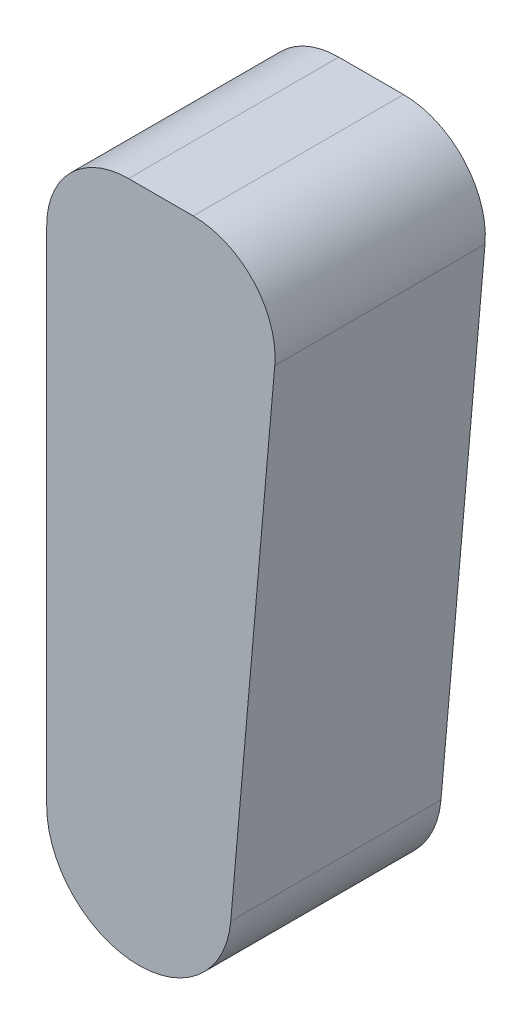
ISO-10303-21;
HEADER;
FILE_DESCRIPTION(('STEP AP214'),'2;1');
FILE_NAME('part.step','',(''),(''),'','','');
FILE_SCHEMA(('AUTOMOTIVE_DESIGN { 1 0 10303 214 1 1 1 1 }'));
ENDSEC;
DATA;
#1=APPLICATION_CONTEXT('core data for automotive mechanical design processes');
#2=APPLICATION_PROTOCOL_DEFINITION('international standard','automotive_design',2000,#1);
#3=PRODUCT_CONTEXT('',#1,'mechanical');
#4=PRODUCT('Part','Part','',(#3));
#5=PRODUCT_RELATED_PRODUCT_CATEGORY('part','',(#4));
#6=PRODUCT_DEFINITION_FORMATION('','',#4);
#7=PRODUCT_DEFINITION_CONTEXT('part definition',#1,'design');
#8=PRODUCT_DEFINITION('design','',#6,#7);
#9=PRODUCT_DEFINITION_SHAPE('','',#8);
#10=(LENGTH_UNIT() NAMED_UNIT(*) SI_UNIT(.MILLI.,.METRE.));
#11=(NAMED_UNIT(*) PLANE_ANGLE_UNIT() SI_UNIT($,.RADIAN.));
#12=(NAMED_UNIT(*) SI_UNIT($,.STERADIAN.) SOLID_ANGLE_UNIT());
#13=UNCERTAINTY_MEASURE_WITH_UNIT(LENGTH_MEASURE(1.E-05),#10,'distance_accuracy_value','');
#14=(GEOMETRIC_REPRESENTATION_CONTEXT(3) GLOBAL_UNCERTAINTY_ASSIGNED_CONTEXT((#13)) GLOBAL_UNIT_ASSIGNED_CONTEXT((#10,
#11,#12)) REPRESENTATION_CONTEXT('',''));
#15=CARTESIAN_POINT('',(0.,0.,0.));
#16=DIRECTION('',(0.,0.,1.));
#17=DIRECTION('',(1.,0.,0.));
#18=AXIS2_PLACEMENT_3D('',#15,#16,#17);
#19=CARTESIAN_POINT('',(-7.89131992586621,50.,18.));
#20=DIRECTION('',(1.,0.,0.));
#21=DIRECTION('',(0.,0.,-1.));
#22=AXIS2_PLACEMENT_3D('',#19,#20,#21);
#23=PLANE('',#22);
#24=DIRECTION('',(0.,-1.,0.));
#25=VECTOR('',#24,1.);
#26=CARTESIAN_POINT('',(-7.89131992586621,50.,18.));
#27=LINE('',#26,#25);
#28=CARTESIAN_POINT('',(-7.89131992586621,43.,18.));
#29=VERTEX_POINT('',#28);
#30=CARTESIAN_POINT('',(-7.89131992586621,0.,18.));
#31=VERTEX_POINT('',#30);
#32=EDGE_CURVE('E85',#29,#31,#27,.T.);
#33=ORIENTED_EDGE('',*,*,#32,.F.);
#34=DIRECTION('',(0.,0.,-1.));
#35=VECTOR('',#34,1.);
#36=CARTESIAN_POINT('',(-7.89131992586621,43.,18.));
#37=LINE('',#36,#35);
#38=CARTESIAN_POINT('',(-7.89131992586621,43.,0.));
#39=VERTEX_POINT('',#38);
#40=EDGE_CURVE('E11',#29,#39,#37,.T.);
#41=ORIENTED_EDGE('',*,*,#40,.T.);
#42=DIRECTION('',(0.,-1.,0.));
#43=VECTOR('',#42,1.);
#44=CARTESIAN_POINT('',(-7.89131992586621,50.,0.));
#45=LINE('',#44,#43);
#46=CARTESIAN_POINT('',(-7.89131992586621,0.,0.));
#47=VERTEX_POINT('',#46);
#48=EDGE_CURVE('E104',#39,#47,#45,.T.);
#49=ORIENTED_EDGE('',*,*,#48,.T.);
#50=DIRECTION('',(0.,0.,-1.));
#51=VECTOR('',#50,1.);
#52=CARTESIAN_POINT('',(-7.89131992586621,0.,18.));
#53=LINE('',#52,#51);
#54=EDGE_CURVE('E98',#31,#47,#53,.T.);
#55=ORIENTED_EDGE('',*,*,#54,.F.);
#56=EDGE_LOOP('',(#33,#41,#49,#55));
#57=FACE_BOUND('',#56,.T.);
#58=ADVANCED_FACE('F32',(#57),#23,.F.);
#59=CARTESIAN_POINT('',(0.,0.,18.));
#60=DIRECTION('',(0.,0.,-1.));
#61=DIRECTION('',(-1.,0.,0.));
#62=AXIS2_PLACEMENT_3D('',#59,#60,#61);
#63=CYLINDRICAL_SURFACE('',#62,7.89131992586621);
#64=CARTESIAN_POINT('',(0.,0.,0.));
#65=DIRECTION('',(0.,0.,1.));
#66=DIRECTION('',(-1.,0.,0.));
#67=AXIS2_PLACEMENT_3D('',#64,#65,#66);
#68=CIRCLE('',#67,7.89131992586621);
#69=CARTESIAN_POINT('',(7.86129107109366,-0.687773849398293,0.));
#70=VERTEX_POINT('',#69);
#71=EDGE_CURVE('E137',#47,#70,#68,.T.);
#72=ORIENTED_EDGE('',*,*,#71,.T.);
#73=DIRECTION('',(0.,0.,-1.));
#74=VECTOR('',#73,1.);
#75=CARTESIAN_POINT('',(7.86129107109366,-0.687773849398293,18.));
#76=LINE('',#75,#74);
#77=CARTESIAN_POINT('',(7.86129107109366,-0.687773849398293,18.));
#78=VERTEX_POINT('',#77);
#79=EDGE_CURVE('E100',#78,#70,#76,.T.);
#80=ORIENTED_EDGE('',*,*,#79,.F.);
#81=CARTESIAN_POINT('',(0.,0.,18.));
#82=DIRECTION('',(0.,0.,1.));
#83=DIRECTION('',(-1.,0.,0.));
#84=AXIS2_PLACEMENT_3D('',#81,#82,#83);
#85=CIRCLE('',#84,7.89131992586621);
#86=EDGE_CURVE('E88',#31,#78,#85,.T.);
#87=ORIENTED_EDGE('',*,*,#86,.F.);
#88=ORIENTED_EDGE('',*,*,#54,.T.);
#89=EDGE_LOOP('',(#72,#80,#87,#88));
#90=FACE_BOUND('',#89,.T.);
#91=ADVANCED_FACE('F97',(#90),#63,.T.);
#92=CARTESIAN_POINT('',(12.295896662282,50.,18.));
#93=DIRECTION('',(-0.996194698091745,0.0871557427476619,0.));
#94=DIRECTION('',(-0.0871557427476619,-0.996194698091745,0.));
#95=AXIS2_PLACEMENT_3D('',#92,#93,#94);
#96=PLANE('',#95);
#97=DIRECTION('',(0.0871557427476619,0.996194698091745,0.));
#98=VECTOR('',#97,1.);
#99=CARTESIAN_POINT('',(12.295896662282,50.,0.));
#100=LINE('',#99,#98);
#101=CARTESIAN_POINT('',(11.6301000414393,42.3899098007664,0.));
#102=VERTEX_POINT('',#101);
#103=EDGE_CURVE('E135',#70,#102,#100,.T.);
#104=ORIENTED_EDGE('',*,*,#103,.T.);
#105=DIRECTION('',(0.,0.,-1.));
#106=VECTOR('',#105,1.);
#107=CARTESIAN_POINT('',(11.6301000414393,42.3899098007664,18.));
#108=LINE('',#107,#106);
#109=CARTESIAN_POINT('',(11.6301000414393,42.3899098007664,18.));
#110=VERTEX_POINT('',#109);
#111=EDGE_CURVE('E55',#102,#110,#108,.F.);
#112=ORIENTED_EDGE('',*,*,#111,.T.);
#113=DIRECTION('',(0.0871557427476619,0.996194698091745,0.));
#114=VECTOR('',#113,1.);
#115=CARTESIAN_POINT('',(12.295896662282,50.,18.));
#116=LINE('',#115,#114);
#117=EDGE_CURVE('E101',#78,#110,#116,.T.);
#118=ORIENTED_EDGE('',*,*,#117,.F.);
#119=ORIENTED_EDGE('',*,*,#79,.T.);
#120=EDGE_LOOP('',(#104,#112,#118,#119));
#121=FACE_BOUND('',#120,.T.);
#122=ADVANCED_FACE('F136',(#121),#96,.F.);
#123=CARTESIAN_POINT('',(-7.89131992586621,50.,18.));
#124=DIRECTION('',(0.,-1.,0.));
#125=DIRECTION('',(0.,0.,-1.));
#126=AXIS2_PLACEMENT_3D('',#123,#124,#125);
#127=PLANE('',#126);
#128=DIRECTION('',(-1.,0.,0.));
#129=VECTOR('',#128,1.);
#130=CARTESIAN_POINT('',(-7.89131992586621,50.,18.));
#131=LINE('',#130,#129);
#132=CARTESIAN_POINT('',(4.65673715479706,50.,18.));
#133=VERTEX_POINT('',#132);
#134=CARTESIAN_POINT('',(-0.891319925866207,50.,18.));
#135=VERTEX_POINT('',#134);
#136=EDGE_CURVE('E110',#133,#135,#131,.T.);
#137=ORIENTED_EDGE('',*,*,#136,.F.);
#138=DIRECTION('',(0.,0.,-1.));
#139=VECTOR('',#138,1.);
#140=CARTESIAN_POINT('',(4.65673715479706,50.,18.));
#141=LINE('',#140,#139);
#142=CARTESIAN_POINT('',(4.65673715479706,50.,0.));
#143=VERTEX_POINT('',#142);
#144=EDGE_CURVE('E108',#133,#143,#141,.T.);
#145=ORIENTED_EDGE('',*,*,#144,.T.);
#146=DIRECTION('',(-1.,0.,0.));
#147=VECTOR('',#146,1.);
#148=CARTESIAN_POINT('',(-7.89131992586621,50.,0.));
#149=LINE('',#148,#147);
#150=CARTESIAN_POINT('',(-0.891319925866207,50.,0.));
#151=VERTEX_POINT('',#150);
#152=EDGE_CURVE('E93',#143,#151,#149,.T.);
#153=ORIENTED_EDGE('',*,*,#152,.T.);
#154=DIRECTION('',(0.,0.,-1.));
#155=VECTOR('',#154,1.);
#156=CARTESIAN_POINT('',(-0.891319925866207,50.,18.));
#157=LINE('',#156,#155);
#158=EDGE_CURVE('E106',#151,#135,#157,.F.);
#159=ORIENTED_EDGE('',*,*,#158,.T.);
#160=EDGE_LOOP('',(#137,#145,#153,#159));
#161=FACE_BOUND('',#160,.T.);
#162=ADVANCED_FACE('F126',(#161),#127,.F.);
#163=CARTESIAN_POINT('',(0.,0.,18.));
#164=DIRECTION('',(0.,0.,-1.));
#165=DIRECTION('',(-1.,0.,0.));
#166=AXIS2_PLACEMENT_3D('',#163,#164,#165);
#167=PLANE('',#166);
#168=ORIENTED_EDGE('',*,*,#117,.T.);
#169=CARTESIAN_POINT('',(4.65673715479706,43.,18.));
#170=DIRECTION('',(0.,0.,-1.));
#171=DIRECTION('',(-1.,0.,0.));
#172=AXIS2_PLACEMENT_3D('',#169,#170,#171);
#173=CIRCLE('',#172,7.);
#174=EDGE_CURVE('E40',#110,#133,#173,.F.);
#175=ORIENTED_EDGE('',*,*,#174,.T.);
#176=ORIENTED_EDGE('',*,*,#136,.T.);
#177=CARTESIAN_POINT('',(-0.891319925866207,43.,18.));
#178=DIRECTION('',(0.,0.,-1.));
#179=DIRECTION('',(-1.,0.,0.));
#180=AXIS2_PLACEMENT_3D('',#177,#178,#179);
#181=CIRCLE('',#180,7.);
#182=EDGE_CURVE('E47',#135,#29,#181,.F.);
#183=ORIENTED_EDGE('',*,*,#182,.T.);
#184=ORIENTED_EDGE('',*,*,#32,.T.);
#185=ORIENTED_EDGE('',*,*,#86,.T.);
#186=EDGE_LOOP('',(#168,#175,#176,#183,#184,#185));
#187=FACE_BOUND('',#186,.T.);
#188=ADVANCED_FACE('F87',(#187),#167,.F.);
#189=CARTESIAN_POINT('',(0.,0.,0.));
#190=DIRECTION('',(0.,0.,-1.));
#191=DIRECTION('',(-1.,0.,0.));
#192=AXIS2_PLACEMENT_3D('',#189,#190,#191);
#193=PLANE('',#192);
#194=ORIENTED_EDGE('',*,*,#152,.F.);
#195=CARTESIAN_POINT('',(4.65673715479706,43.,0.));
#196=DIRECTION('',(0.,0.,-1.));
#197=DIRECTION('',(-1.,0.,0.));
#198=AXIS2_PLACEMENT_3D('',#195,#196,#197);
#199=CIRCLE('',#198,7.);
#200=EDGE_CURVE('E118',#143,#102,#199,.T.);
#201=ORIENTED_EDGE('',*,*,#200,.T.);
#202=ORIENTED_EDGE('',*,*,#103,.F.);
#203=ORIENTED_EDGE('',*,*,#71,.F.);
#204=ORIENTED_EDGE('',*,*,#48,.F.);
#205=CARTESIAN_POINT('',(-0.891319925866207,43.,0.));
#206=DIRECTION('',(0.,0.,-1.));
#207=DIRECTION('',(-1.,0.,0.));
#208=AXIS2_PLACEMENT_3D('',#205,#206,#207);
#209=CIRCLE('',#208,7.);
#210=EDGE_CURVE('E116',#39,#151,#209,.T.);
#211=ORIENTED_EDGE('',*,*,#210,.T.);
#212=EDGE_LOOP('',(#194,#201,#202,#203,#204,#211));
#213=FACE_BOUND('',#212,.T.);
#214=ADVANCED_FACE('F134',(#213),#193,.T.);
#215=CARTESIAN_POINT('',(4.65673715479706,43.,18.));
#216=DIRECTION('',(0.,0.,-1.));
#217=DIRECTION('',(-1.,0.,0.));
#218=AXIS2_PLACEMENT_3D('',#215,#216,#217);
#219=CYLINDRICAL_SURFACE('',#218,7.);
#220=ORIENTED_EDGE('',*,*,#174,.F.);
#221=ORIENTED_EDGE('',*,*,#111,.F.);
#222=ORIENTED_EDGE('',*,*,#200,.F.);
#223=ORIENTED_EDGE('',*,*,#144,.F.);
#224=EDGE_LOOP('',(#220,#221,#222,#223));
#225=FACE_BOUND('',#224,.T.);
#226=ADVANCED_FACE('F131',(#225),#219,.T.);
#227=CARTESIAN_POINT('',(-0.891319925866207,43.,18.));
#228=DIRECTION('',(0.,0.,-1.));
#229=DIRECTION('',(-1.,0.,0.));
#230=AXIS2_PLACEMENT_3D('',#227,#228,#229);
#231=CYLINDRICAL_SURFACE('',#230,7.);
#232=ORIENTED_EDGE('',*,*,#182,.F.);
#233=ORIENTED_EDGE('',*,*,#158,.F.);
#234=ORIENTED_EDGE('',*,*,#210,.F.);
#235=ORIENTED_EDGE('',*,*,#40,.F.);
#236=EDGE_LOOP('',(#232,#233,#234,#235));
#237=FACE_BOUND('',#236,.T.);
#238=ADVANCED_FACE('F34',(#237),#231,.T.);
#239=CLOSED_SHELL('',(#58,#91,#122,#162,#188,#214,#226,#238));
#240=MANIFOLD_SOLID_BREP('B2',#239);
#241=ADVANCED_BREP_SHAPE_REPRESENTATION('',(#18,#240),#14);
#242=SHAPE_DEFINITION_REPRESENTATION(#9,#241);
ENDSEC;
END-ISO-10303-21;
